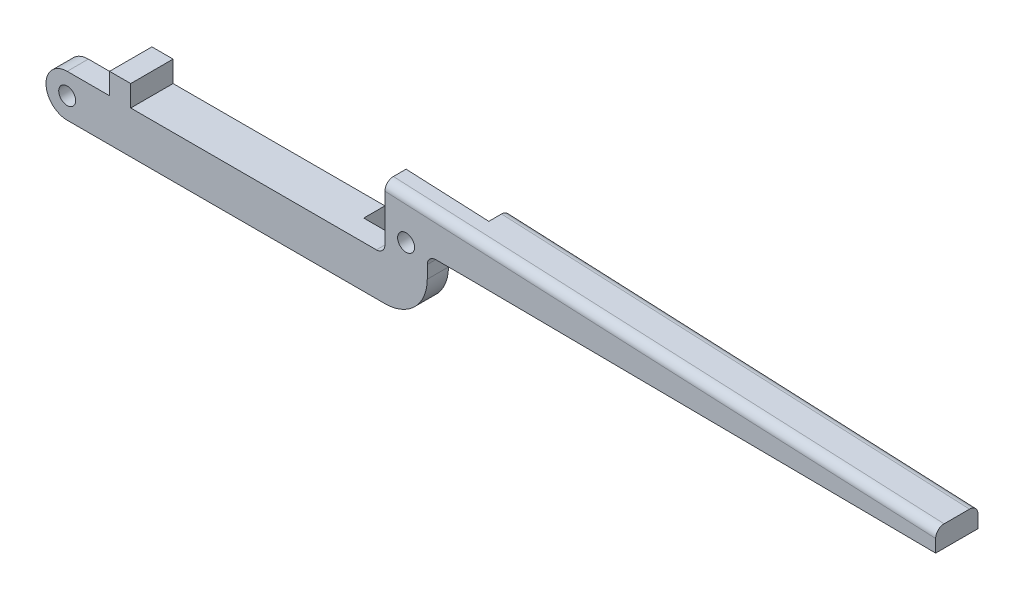
ISO-10303-21;
HEADER;
FILE_DESCRIPTION(('STEP AP214'),'2;1');
FILE_NAME('part.step','',(''),(''),'','','');
FILE_SCHEMA(('AUTOMOTIVE_DESIGN { 1 0 10303 214 1 1 1 1 }'));
ENDSEC;
DATA;
#1=APPLICATION_CONTEXT('core data for automotive mechanical design processes');
#2=APPLICATION_PROTOCOL_DEFINITION('international standard','automotive_design',2000,#1);
#3=PRODUCT_CONTEXT('',#1,'mechanical');
#4=PRODUCT('Part','Part','',(#3));
#5=PRODUCT_RELATED_PRODUCT_CATEGORY('part','',(#4));
#6=PRODUCT_DEFINITION_FORMATION('','',#4);
#7=PRODUCT_DEFINITION_CONTEXT('part definition',#1,'design');
#8=PRODUCT_DEFINITION('design','',#6,#7);
#9=PRODUCT_DEFINITION_SHAPE('','',#8);
#10=(LENGTH_UNIT() NAMED_UNIT(*) SI_UNIT(.MILLI.,.METRE.));
#11=(NAMED_UNIT(*) PLANE_ANGLE_UNIT() SI_UNIT($,.RADIAN.));
#12=(NAMED_UNIT(*) SI_UNIT($,.STERADIAN.) SOLID_ANGLE_UNIT());
#13=UNCERTAINTY_MEASURE_WITH_UNIT(LENGTH_MEASURE(1.E-05),#10,'distance_accuracy_value','');
#14=(GEOMETRIC_REPRESENTATION_CONTEXT(3) GLOBAL_UNCERTAINTY_ASSIGNED_CONTEXT((#13)) GLOBAL_UNIT_ASSIGNED_CONTEXT((#10,
#11,#12)) REPRESENTATION_CONTEXT('',''));
#15=CARTESIAN_POINT('',(0.,0.,0.));
#16=DIRECTION('',(0.,0.,1.));
#17=DIRECTION('',(1.,0.,0.));
#18=AXIS2_PLACEMENT_3D('',#15,#16,#17);
#19=CARTESIAN_POINT('',(22.500000000004,0.,2.5));
#20=DIRECTION('',(0.,1.,0.));
#21=DIRECTION('',(-1.,0.,0.));
#22=AXIS2_PLACEMENT_3D('',#19,#20,#21);
#23=PLANE('',#22);
#24=DIRECTION('',(0.,0.,-1.));
#25=VECTOR('',#24,1.);
#26=CARTESIAN_POINT('',(24.8820796081007,0.,2.5));
#27=LINE('',#26,#25);
#28=CARTESIAN_POINT('',(24.8820796081007,0.,2.5));
#29=VERTEX_POINT('',#28);
#30=CARTESIAN_POINT('',(24.8820796081007,0.,1.25));
#31=VERTEX_POINT('',#30);
#32=EDGE_CURVE('E234',#29,#31,#27,.T.);
#33=ORIENTED_EDGE('',*,*,#32,.F.);
#34=DIRECTION('',(1.,0.,0.));
#35=VECTOR('',#34,1.);
#36=CARTESIAN_POINT('',(22.500000000004,0.,2.5));
#37=LINE('',#36,#35);
#38=CARTESIAN_POINT('',(23.0000000000034,0.,2.5));
#39=VERTEX_POINT('',#38);
#40=EDGE_CURVE('E338',#39,#29,#37,.T.);
#41=ORIENTED_EDGE('',*,*,#40,.F.);
#42=DIRECTION('',(0.,0.,-1.));
#43=VECTOR('',#42,1.);
#44=CARTESIAN_POINT('',(23.0000000000034,0.,1.25));
#45=LINE('',#44,#43);
#46=CARTESIAN_POINT('',(23.0000000000034,0.,1.25));
#47=VERTEX_POINT('',#46);
#48=EDGE_CURVE('E378',#39,#47,#45,.T.);
#49=ORIENTED_EDGE('',*,*,#48,.T.);
#50=DIRECTION('',(-1.,0.,0.));
#51=VECTOR('',#50,1.);
#52=CARTESIAN_POINT('',(24.8820796081007,0.,1.25));
#53=LINE('',#52,#51);
#54=EDGE_CURVE('E273',#31,#47,#53,.T.);
#55=ORIENTED_EDGE('',*,*,#54,.F.);
#56=EDGE_LOOP('',(#33,#41,#49,#55));
#57=FACE_BOUND('',#56,.T.);
#58=ADVANCED_FACE('F40',(#57),#23,.F.);
#59=CARTESIAN_POINT('',(0.,-1.25,2.5));
#60=DIRECTION('',(0.,-1.,0.));
#61=DIRECTION('',(0.,0.,-1.));
#62=AXIS2_PLACEMENT_3D('',#59,#60,#61);
#63=PLANE('',#62);
#64=DIRECTION('',(-1.,0.,0.));
#65=VECTOR('',#64,1.);
#66=CARTESIAN_POINT('',(0.,-1.25,2.5));
#67=LINE('',#66,#65);
#68=CARTESIAN_POINT('',(3.75,-1.25,2.5));
#69=VERTEX_POINT('',#68);
#70=CARTESIAN_POINT('',(1.25,-1.25,2.5));
#71=VERTEX_POINT('',#70);
#72=EDGE_CURVE('E196',#69,#71,#67,.T.);
#73=ORIENTED_EDGE('',*,*,#72,.F.);
#74=DIRECTION('',(0.,0.,-1.));
#75=VECTOR('',#74,1.);
#76=CARTESIAN_POINT('',(3.75,-1.25,2.5));
#77=LINE('',#76,#75);
#78=CARTESIAN_POINT('',(3.75,-1.25,0.));
#79=VERTEX_POINT('',#78);
#80=EDGE_CURVE('E198',#69,#79,#77,.T.);
#81=ORIENTED_EDGE('',*,*,#80,.T.);
#82=DIRECTION('',(-1.,0.,0.));
#83=VECTOR('',#82,1.);
#84=CARTESIAN_POINT('',(2.5,-1.25,0.));
#85=LINE('',#84,#83);
#86=CARTESIAN_POINT('',(2.5,-1.25,0.));
#87=VERTEX_POINT('',#86);
#88=EDGE_CURVE('E219',#79,#87,#85,.T.);
#89=ORIENTED_EDGE('',*,*,#88,.T.);
#90=DIRECTION('',(0.,0.,-1.));
#91=VECTOR('',#90,1.);
#92=CARTESIAN_POINT('',(2.5,-1.25,2.5));
#93=LINE('',#92,#91);
#94=CARTESIAN_POINT('',(2.5,-1.25,1.25));
#95=VERTEX_POINT('',#94);
#96=EDGE_CURVE('E211',#95,#87,#93,.T.);
#97=ORIENTED_EDGE('',*,*,#96,.F.);
#98=DIRECTION('',(1.,0.,0.));
#99=VECTOR('',#98,1.);
#100=CARTESIAN_POINT('',(0.,-1.25,1.25));
#101=LINE('',#100,#99);
#102=CARTESIAN_POINT('',(1.25,-1.25,1.25));
#103=VERTEX_POINT('',#102);
#104=EDGE_CURVE('E307',#103,#95,#101,.T.);
#105=ORIENTED_EDGE('',*,*,#104,.F.);
#106=DIRECTION('',(0.,0.,-1.));
#107=VECTOR('',#106,1.);
#108=CARTESIAN_POINT('',(1.25,-1.25,2.5));
#109=LINE('',#108,#107);
#110=EDGE_CURVE('E201',#71,#103,#109,.T.);
#111=ORIENTED_EDGE('',*,*,#110,.F.);
#112=EDGE_LOOP('',(#73,#81,#89,#97,#105,#111));
#113=FACE_BOUND('',#112,.T.);
#114=ADVANCED_FACE('F197',(#113),#63,.F.);
#115=DIRECTION('',(0.,0.,-1.));
#116=VECTOR('',#115,1.);
#117=CARTESIAN_POINT('',(5.,-1.25,0.));
#118=LINE('',#117,#116);
#119=CARTESIAN_POINT('',(5.,-1.25,2.5));
#120=VERTEX_POINT('',#119);
#121=CARTESIAN_POINT('',(5.,-1.25,0.));
#122=VERTEX_POINT('',#121);
#123=EDGE_CURVE('E237',#120,#122,#118,.T.);
#124=ORIENTED_EDGE('',*,*,#123,.F.);
#125=CARTESIAN_POINT('',(19.5,-1.25,2.5));
#126=VERTEX_POINT('',#125);
#127=EDGE_CURVE('E204',#126,#120,#67,.T.);
#128=ORIENTED_EDGE('',*,*,#127,.F.);
#129=DIRECTION('',(0.,0.,-1.));
#130=VECTOR('',#129,1.);
#131=CARTESIAN_POINT('',(19.5,-1.25,1.25));
#132=LINE('',#131,#130);
#133=CARTESIAN_POINT('',(19.5,-1.25,1.25));
#134=VERTEX_POINT('',#133);
#135=EDGE_CURVE('E387',#126,#134,#132,.T.);
#136=ORIENTED_EDGE('',*,*,#135,.T.);
#137=DIRECTION('',(1.,0.,0.));
#138=VECTOR('',#137,1.);
#139=CARTESIAN_POINT('',(20.,-1.25,1.25));
#140=LINE('',#139,#138);
#141=CARTESIAN_POINT('',(17.5,-1.25,1.25));
#142=VERTEX_POINT('',#141);
#143=EDGE_CURVE('E288',#142,#134,#140,.T.);
#144=ORIENTED_EDGE('',*,*,#143,.F.);
#145=DIRECTION('',(0.,0.,-1.));
#146=VECTOR('',#145,1.);
#147=CARTESIAN_POINT('',(17.5,-1.25,1.25));
#148=LINE('',#147,#146);
#149=CARTESIAN_POINT('',(17.5,-1.25,0.));
#150=VERTEX_POINT('',#149);
#151=EDGE_CURVE('E295',#142,#150,#148,.T.);
#152=ORIENTED_EDGE('',*,*,#151,.T.);
#153=DIRECTION('',(-1.,0.,0.));
#154=VECTOR('',#153,1.);
#155=CARTESIAN_POINT('',(0.,-1.25,0.));
#156=LINE('',#155,#154);
#157=EDGE_CURVE('E332',#150,#122,#156,.T.);
#158=ORIENTED_EDGE('',*,*,#157,.T.);
#159=EDGE_LOOP('',(#124,#128,#136,#144,#152,#158));
#160=FACE_BOUND('',#159,.T.);
#161=ADVANCED_FACE('F403',(#160),#63,.F.);
#162=CARTESIAN_POINT('',(0.,0.,0.));
#163=DIRECTION('',(0.,0.,1.));
#164=DIRECTION('',(1.,0.,0.));
#165=AXIS2_PLACEMENT_3D('',#162,#163,#164);
#166=PLANE('',#165);
#167=DIRECTION('',(0.,1.,0.));
#168=VECTOR('',#167,1.);
#169=CARTESIAN_POINT('',(2.5,0.,0.));
#170=LINE('',#169,#168);
#171=CARTESIAN_POINT('',(2.5,-3.75,0.));
#172=VERTEX_POINT('',#171);
#173=EDGE_CURVE('E254',#172,#87,#170,.T.);
#174=ORIENTED_EDGE('',*,*,#173,.T.);
#175=ORIENTED_EDGE('',*,*,#88,.F.);
#176=DIRECTION('',(0.,-1.,0.));
#177=VECTOR('',#176,1.);
#178=CARTESIAN_POINT('',(3.75,-1.25,0.));
#179=LINE('',#178,#177);
#180=CARTESIAN_POINT('',(3.75,0.,0.));
#181=VERTEX_POINT('',#180);
#182=EDGE_CURVE('E209',#181,#79,#179,.T.);
#183=ORIENTED_EDGE('',*,*,#182,.F.);
#184=DIRECTION('',(-1.,0.,0.));
#185=VECTOR('',#184,1.);
#186=CARTESIAN_POINT('',(2.5,0.,0.));
#187=LINE('',#186,#185);
#188=CARTESIAN_POINT('',(5.,0.,0.));
#189=VERTEX_POINT('',#188);
#190=EDGE_CURVE('E242',#189,#181,#187,.T.);
#191=ORIENTED_EDGE('',*,*,#190,.F.);
#192=DIRECTION('',(0.,-1.,0.));
#193=VECTOR('',#192,1.);
#194=CARTESIAN_POINT('',(5.,0.,0.));
#195=LINE('',#194,#193);
#196=EDGE_CURVE('E245',#189,#122,#195,.T.);
#197=ORIENTED_EDGE('',*,*,#196,.T.);
#198=ORIENTED_EDGE('',*,*,#157,.F.);
#199=DIRECTION('',(0.,1.,0.));
#200=VECTOR('',#199,1.);
#201=CARTESIAN_POINT('',(17.5,-1.25,0.));
#202=LINE('',#201,#200);
#203=CARTESIAN_POINT('',(17.5,-3.75,0.));
#204=VERTEX_POINT('',#203);
#205=EDGE_CURVE('E258',#204,#150,#202,.T.);
#206=ORIENTED_EDGE('',*,*,#205,.F.);
#207=DIRECTION('',(1.,0.,0.));
#208=VECTOR('',#207,1.);
#209=CARTESIAN_POINT('',(20.,-3.75,0.));
#210=LINE('',#209,#208);
#211=EDGE_CURVE('E347',#172,#204,#210,.T.);
#212=ORIENTED_EDGE('',*,*,#211,.F.);
#213=EDGE_LOOP('',(#174,#175,#183,#191,#197,#198,#206,#212));
#214=FACE_BOUND('',#213,.T.);
#215=ADVANCED_FACE('F414',(#214),#166,.F.);
#216=CARTESIAN_POINT('',(20.,-3.75,2.5));
#217=DIRECTION('',(0.,1.,0.));
#218=DIRECTION('',(0.,0.,1.));
#219=AXIS2_PLACEMENT_3D('',#216,#217,#218);
#220=PLANE('',#219);
#221=DIRECTION('',(0.,0.,-1.));
#222=VECTOR('',#221,1.);
#223=CARTESIAN_POINT('',(2.5,-3.75,1.25));
#224=LINE('',#223,#222);
#225=CARTESIAN_POINT('',(2.5,-3.75,1.25));
#226=VERTEX_POINT('',#225);
#227=EDGE_CURVE('E251',#226,#172,#224,.T.);
#228=ORIENTED_EDGE('',*,*,#227,.T.);
#229=ORIENTED_EDGE('',*,*,#211,.T.);
#230=DIRECTION('',(0.,0.,-1.));
#231=VECTOR('',#230,1.);
#232=CARTESIAN_POINT('',(17.5,-3.75,1.25));
#233=LINE('',#232,#231);
#234=CARTESIAN_POINT('',(17.5,-3.75,1.25));
#235=VERTEX_POINT('',#234);
#236=EDGE_CURVE('E265',#235,#204,#233,.T.);
#237=ORIENTED_EDGE('',*,*,#236,.F.);
#238=DIRECTION('',(-1.,0.,0.));
#239=VECTOR('',#238,1.);
#240=CARTESIAN_POINT('',(17.5,-3.75,1.25));
#241=LINE('',#240,#239);
#242=CARTESIAN_POINT('',(20.,-3.75,1.25));
#243=VERTEX_POINT('',#242);
#244=EDGE_CURVE('E261',#243,#235,#241,.T.);
#245=ORIENTED_EDGE('',*,*,#244,.F.);
#246=DIRECTION('',(0.,0.,-1.));
#247=VECTOR('',#246,1.);
#248=CARTESIAN_POINT('',(20.,-3.75,2.5));
#249=LINE('',#248,#247);
#250=CARTESIAN_POINT('',(20.,-3.75,2.5));
#251=VERTEX_POINT('',#250);
#252=EDGE_CURVE('E285',#251,#243,#249,.T.);
#253=ORIENTED_EDGE('',*,*,#252,.F.);
#254=DIRECTION('',(1.,0.,0.));
#255=VECTOR('',#254,1.);
#256=CARTESIAN_POINT('',(0.,-3.75,2.5));
#257=LINE('',#256,#255);
#258=CARTESIAN_POINT('',(1.25,-3.75,2.5));
#259=VERTEX_POINT('',#258);
#260=EDGE_CURVE('E335',#259,#251,#257,.T.);
#261=ORIENTED_EDGE('',*,*,#260,.F.);
#262=DIRECTION('',(0.,0.,-1.));
#263=VECTOR('',#262,1.);
#264=CARTESIAN_POINT('',(1.25,-3.75,2.5));
#265=LINE('',#264,#263);
#266=CARTESIAN_POINT('',(1.25,-3.75,1.25));
#267=VERTEX_POINT('',#266);
#268=EDGE_CURVE('E294',#259,#267,#265,.T.);
#269=ORIENTED_EDGE('',*,*,#268,.T.);
#270=DIRECTION('',(-1.,0.,0.));
#271=VECTOR('',#270,1.);
#272=CARTESIAN_POINT('',(0.,-3.75,1.25));
#273=LINE('',#272,#271);
#274=EDGE_CURVE('E311',#226,#267,#273,.T.);
#275=ORIENTED_EDGE('',*,*,#274,.F.);
#276=EDGE_LOOP('',(#228,#229,#237,#245,#253,#261,#269,#275));
#277=FACE_BOUND('',#276,.T.);
#278=ADVANCED_FACE('F435',(#277),#220,.F.);
#279=CARTESIAN_POINT('',(0.,0.,1.25));
#280=DIRECTION('',(0.,0.,-1.));
#281=DIRECTION('',(-1.,0.,0.));
#282=AXIS2_PLACEMENT_3D('',#279,#280,#281);
#283=PLANE('',#282);
#284=CARTESIAN_POINT('',(1.25,-2.5,1.25));
#285=DIRECTION('',(0.,0.,-1.));
#286=DIRECTION('',(-1.,0.,0.));
#287=AXIS2_PLACEMENT_3D('',#284,#285,#286);
#288=CIRCLE('',#287,0.5);
#289=CARTESIAN_POINT('',(0.75,-2.5,1.25));
#290=VERTEX_POINT('',#289);
#291=EDGE_CURVE('E313',#290,#290,#288,.F.);
#292=ORIENTED_EDGE('',*,*,#291,.T.);
#293=EDGE_LOOP('',(#292));
#294=FACE_BOUND('',#293,.T.);
#295=ORIENTED_EDGE('',*,*,#104,.T.);
#296=DIRECTION('',(0.,1.,0.));
#297=VECTOR('',#296,1.);
#298=CARTESIAN_POINT('',(2.5,0.,1.25));
#299=LINE('',#298,#297);
#300=EDGE_CURVE('E255',#226,#95,#299,.T.);
#301=ORIENTED_EDGE('',*,*,#300,.F.);
#302=ORIENTED_EDGE('',*,*,#274,.T.);
#303=CARTESIAN_POINT('',(1.25,-2.5,1.25));
#304=DIRECTION('',(0.,0.,-1.));
#305=DIRECTION('',(-1.,0.,0.));
#306=AXIS2_PLACEMENT_3D('',#303,#304,#305);
#307=CIRCLE('',#306,1.25);
#308=EDGE_CURVE('E301',#267,#103,#307,.T.);
#309=ORIENTED_EDGE('',*,*,#308,.T.);
#310=EDGE_LOOP('',(#295,#301,#302,#309));
#311=FACE_BOUND('',#310,.T.);
#312=ADVANCED_FACE('F428',(#294,#311),#283,.T.);
#313=CARTESIAN_POINT('',(22.500000000004,0.,2.5));
#314=DIRECTION('',(-1.,1.06118817437088E-12,0.));
#315=DIRECTION('',(-1.06118817437088E-12,-1.,0.));
#316=AXIS2_PLACEMENT_3D('',#313,#314,#315);
#317=PLANE('',#316);
#318=DIRECTION('',(0.,-1.,0.));
#319=VECTOR('',#318,1.);
#320=CARTESIAN_POINT('',(22.5,-3.75,1.25));
#321=LINE('',#320,#319);
#322=CARTESIAN_POINT('',(22.5,-0.49999999999947,1.25));
#323=VERTEX_POINT('',#322);
#324=CARTESIAN_POINT('',(22.5,-1.25,1.25));
#325=VERTEX_POINT('',#324);
#326=EDGE_CURVE('E308',#323,#325,#321,.T.);
#327=ORIENTED_EDGE('',*,*,#326,.F.);
#328=DIRECTION('',(0.,0.,-1.));
#329=VECTOR('',#328,1.);
#330=CARTESIAN_POINT('',(22.5000000000034,-0.499999999999469,2.5));
#331=LINE('',#330,#329);
#332=CARTESIAN_POINT('',(22.5,-0.49999999999947,2.5));
#333=VERTEX_POINT('',#332);
#334=EDGE_CURVE('E381',#323,#333,#331,.F.);
#335=ORIENTED_EDGE('',*,*,#334,.T.);
#336=DIRECTION('',(0.,1.,0.));
#337=VECTOR('',#336,1.);
#338=CARTESIAN_POINT('',(22.5,-3.75,2.5));
#339=LINE('',#338,#337);
#340=CARTESIAN_POINT('',(22.5,-1.25,2.5));
#341=VERTEX_POINT('',#340);
#342=EDGE_CURVE('E322',#341,#333,#339,.T.);
#343=ORIENTED_EDGE('',*,*,#342,.F.);
#344=DIRECTION('',(0.,0.,-1.));
#345=VECTOR('',#344,1.);
#346=CARTESIAN_POINT('',(22.5,-1.25,2.5));
#347=LINE('',#346,#345);
#348=EDGE_CURVE('E282',#341,#325,#347,.T.);
#349=ORIENTED_EDGE('',*,*,#348,.T.);
#350=EDGE_LOOP('',(#327,#335,#343,#349));
#351=FACE_BOUND('',#350,.T.);
#352=ADVANCED_FACE('F442',(#351),#317,.F.);
#353=CARTESIAN_POINT('',(0.,0.,2.5));
#354=DIRECTION('',(0.,0.,1.));
#355=DIRECTION('',(1.,0.,0.));
#356=AXIS2_PLACEMENT_3D('',#353,#354,#355);
#357=PLANE('',#356);
#358=DIRECTION('',(0.,-1.,0.));
#359=VECTOR('',#358,1.);
#360=CARTESIAN_POINT('',(3.75,-1.25,2.5));
#361=LINE('',#360,#359);
#362=CARTESIAN_POINT('',(3.75,0.,2.5));
#363=VERTEX_POINT('',#362);
#364=EDGE_CURVE('E55',#363,#69,#361,.T.);
#365=ORIENTED_EDGE('',*,*,#364,.T.);
#366=ORIENTED_EDGE('',*,*,#72,.T.);
#367=CARTESIAN_POINT('',(1.25,-2.5,2.5));
#368=DIRECTION('',(0.,0.,-1.));
#369=DIRECTION('',(-1.,0.,0.));
#370=AXIS2_PLACEMENT_3D('',#367,#368,#369);
#371=CIRCLE('',#370,1.25);
#372=EDGE_CURVE('E302',#259,#71,#371,.T.);
#373=ORIENTED_EDGE('',*,*,#372,.F.);
#374=ORIENTED_EDGE('',*,*,#260,.T.);
#375=CARTESIAN_POINT('',(20.,-1.25,2.5));
#376=DIRECTION('',(0.,0.,1.));
#377=DIRECTION('',(-1.,0.,0.));
#378=AXIS2_PLACEMENT_3D('',#375,#376,#377);
#379=CIRCLE('',#378,2.5);
#380=EDGE_CURVE('E279',#251,#341,#379,.T.);
#381=ORIENTED_EDGE('',*,*,#380,.T.);
#382=ORIENTED_EDGE('',*,*,#342,.T.);
#383=CARTESIAN_POINT('',(23.0000000000034,-0.5,2.5));
#384=DIRECTION('',(0.,0.,1.));
#385=DIRECTION('',(1.,0.,0.));
#386=AXIS2_PLACEMENT_3D('',#383,#384,#385);
#387=CIRCLE('',#386,0.5);
#388=EDGE_CURVE('E385',#333,#39,#387,.F.);
#389=ORIENTED_EDGE('',*,*,#388,.T.);
#390=ORIENTED_EDGE('',*,*,#40,.T.);
#391=DIRECTION('',(0.999959032318532,-0.00905172274133137,0.));
#392=VECTOR('',#391,1.);
#393=CARTESIAN_POINT('',(24.8820796081007,0.,2.5));
#394=LINE('',#393,#392);
#395=CARTESIAN_POINT('',(52.5,-0.25,2.5));
#396=VERTEX_POINT('',#395);
#397=EDGE_CURVE('E228',#29,#396,#394,.T.);
#398=ORIENTED_EDGE('',*,*,#397,.T.);
#399=DIRECTION('',(0.,1.,0.));
#400=VECTOR('',#399,1.);
#401=CARTESIAN_POINT('',(52.5,0.,2.5));
#402=LINE('',#401,#400);
#403=CARTESIAN_POINT('',(52.5,0.499467738923156,2.5));
#404=VERTEX_POINT('',#403);
#405=EDGE_CURVE('E341',#396,#404,#402,.T.);
#406=ORIENTED_EDGE('',*,*,#405,.T.);
#407=DIRECTION('',(-0.998936609848685,0.0461047666084009,0.));
#408=VECTOR('',#407,1.);
#409=CARTESIAN_POINT('',(19.9769476166958,2.00053169507566,2.5));
#410=LINE('',#409,#408);
#411=CARTESIAN_POINT('',(20.,1.99946773892316,2.5));
#412=VERTEX_POINT('',#411);
#413=EDGE_CURVE('E373',#404,#412,#410,.T.);
#414=ORIENTED_EDGE('',*,*,#413,.T.);
#415=DIRECTION('',(0.,-1.,0.));
#416=VECTOR('',#415,1.);
#417=CARTESIAN_POINT('',(20.,-3.75,2.5));
#418=LINE('',#417,#416);
#419=CARTESIAN_POINT('',(20.,-0.75,2.5));
#420=VERTEX_POINT('',#419);
#421=EDGE_CURVE('E325',#412,#420,#418,.T.);
#422=ORIENTED_EDGE('',*,*,#421,.T.);
#423=CARTESIAN_POINT('',(19.5,-0.75,2.5));
#424=DIRECTION('',(0.,0.,1.));
#425=DIRECTION('',(1.,0.,0.));
#426=AXIS2_PLACEMENT_3D('',#423,#424,#425);
#427=CIRCLE('',#426,0.5);
#428=EDGE_CURVE('E11',#420,#126,#427,.F.);
#429=ORIENTED_EDGE('',*,*,#428,.T.);
#430=ORIENTED_EDGE('',*,*,#127,.T.);
#431=DIRECTION('',(0.,-1.,0.));
#432=VECTOR('',#431,1.);
#433=CARTESIAN_POINT('',(5.,0.,2.5));
#434=LINE('',#433,#432);
#435=CARTESIAN_POINT('',(5.,0.,2.5));
#436=VERTEX_POINT('',#435);
#437=EDGE_CURVE('E249',#436,#120,#434,.T.);
#438=ORIENTED_EDGE('',*,*,#437,.F.);
#439=DIRECTION('',(1.,0.,0.));
#440=VECTOR('',#439,1.);
#441=CARTESIAN_POINT('',(2.5,0.,2.5));
#442=LINE('',#441,#440);
#443=EDGE_CURVE('E218',#363,#436,#442,.T.);
#444=ORIENTED_EDGE('',*,*,#443,.F.);
#445=EDGE_LOOP('',(#365,#366,#373,#374,#381,#382,#389,#390,#398,#406,#414,#422,#429,#430,#438,#444));
#446=FACE_BOUND('',#445,.T.);
#447=CARTESIAN_POINT('',(1.25,-2.5,2.5));
#448=DIRECTION('',(0.,0.,1.));
#449=DIRECTION('',(1.,0.,0.));
#450=AXIS2_PLACEMENT_3D('',#447,#448,#449);
#451=CIRCLE('',#450,0.5);
#452=CARTESIAN_POINT('',(1.75,-2.5,2.5));
#453=VERTEX_POINT('',#452);
#454=EDGE_CURVE('E328',#453,#453,#451,.T.);
#455=ORIENTED_EDGE('',*,*,#454,.F.);
#456=EDGE_LOOP('',(#455));
#457=FACE_BOUND('',#456,.T.);
#458=CARTESIAN_POINT('',(21.25,0.,2.5));
#459=DIRECTION('',(0.,0.,1.));
#460=DIRECTION('',(1.,0.,0.));
#461=AXIS2_PLACEMENT_3D('',#458,#459,#460);
#462=CIRCLE('',#461,0.500000000000002);
#463=CARTESIAN_POINT('',(21.75,0.,2.5));
#464=VERTEX_POINT('',#463);
#465=EDGE_CURVE('E320',#464,#464,#462,.T.);
#466=ORIENTED_EDGE('',*,*,#465,.F.);
#467=EDGE_LOOP('',(#466));
#468=FACE_BOUND('',#467,.T.);
#469=ADVANCED_FACE('F215',(#446,#457,#468),#357,.T.);
#470=DIRECTION('',(0.,1.,0.));
#471=VECTOR('',#470,1.);
#472=CARTESIAN_POINT('',(52.5,0.,0.));
#473=LINE('',#472,#471);
#474=CARTESIAN_POINT('',(52.5,-0.25,0.));
#475=VERTEX_POINT('',#474);
#476=CARTESIAN_POINT('',(52.5,0.499467738923155,0.));
#477=VERTEX_POINT('',#476);
#478=EDGE_CURVE('E205',#475,#477,#473,.T.);
#479=ORIENTED_EDGE('',*,*,#478,.F.);
#480=DIRECTION('',(0.999959032318532,-0.00905172274133137,0.));
#481=VECTOR('',#480,1.);
#482=CARTESIAN_POINT('',(24.8820796081007,0.,0.));
#483=LINE('',#482,#481);
#484=CARTESIAN_POINT('',(24.8820796081007,0.,0.));
#485=VERTEX_POINT('',#484);
#486=EDGE_CURVE('E226',#485,#475,#483,.T.);
#487=ORIENTED_EDGE('',*,*,#486,.F.);
#488=DIRECTION('',(0.,-1.,0.));
#489=VECTOR('',#488,1.);
#490=CARTESIAN_POINT('',(24.8820796081007,2.27467324885689,0.));
#491=LINE('',#490,#489);
#492=CARTESIAN_POINT('',(24.8820796081007,1.77414098778005,0.));
#493=VERTEX_POINT('',#492);
#494=EDGE_CURVE('E269',#493,#485,#491,.T.);
#495=ORIENTED_EDGE('',*,*,#494,.F.);
#496=DIRECTION('',(-0.998936609848685,0.0461047666084009,0.));
#497=VECTOR('',#496,1.);
#498=CARTESIAN_POINT('',(0.134599954910254,2.91633235638884,0.));
#499=LINE('',#498,#497);
#500=EDGE_CURVE('E367',#493,#477,#499,.F.);
#501=ORIENTED_EDGE('',*,*,#500,.T.);
#502=EDGE_LOOP('',(#479,#487,#495,#501));
#503=FACE_BOUND('',#502,.T.);
#504=ADVANCED_FACE('F468',(#503),#166,.F.);
#505=CARTESIAN_POINT('',(1.25,-2.5,0.));
#506=DIRECTION('',(0.,0.,1.));
#507=DIRECTION('',(1.,0.,0.));
#508=AXIS2_PLACEMENT_3D('',#505,#506,#507);
#509=CYLINDRICAL_SURFACE('',#508,0.5);
#510=ORIENTED_EDGE('',*,*,#454,.T.);
#511=EDGE_LOOP('',(#510));
#512=FACE_BOUND('',#511,.T.);
#513=ORIENTED_EDGE('',*,*,#291,.F.);
#514=EDGE_LOOP('',(#513));
#515=FACE_BOUND('',#514,.T.);
#516=ADVANCED_FACE('F512',(#512,#515),#509,.F.);
#517=CARTESIAN_POINT('',(20.,-1.25,2.5));
#518=DIRECTION('',(1.,0.,0.));
#519=DIRECTION('',(0.,0.,-1.));
#520=AXIS2_PLACEMENT_3D('',#517,#518,#519);
#521=PLANE('',#520);
#522=DIRECTION('',(0.,1.,0.));
#523=VECTOR('',#522,1.);
#524=CARTESIAN_POINT('',(20.,-3.75,1.25));
#525=LINE('',#524,#523);
#526=CARTESIAN_POINT('',(20.,-0.75,1.25));
#527=VERTEX_POINT('',#526);
#528=CARTESIAN_POINT('',(20.,2.5,1.25));
#529=VERTEX_POINT('',#528);
#530=EDGE_CURVE('E310',#527,#529,#525,.T.);
#531=ORIENTED_EDGE('',*,*,#530,.F.);
#532=DIRECTION('',(0.,0.,-1.));
#533=VECTOR('',#532,1.);
#534=CARTESIAN_POINT('',(20.,-0.75,2.5));
#535=LINE('',#534,#533);
#536=EDGE_CURVE('E390',#527,#420,#535,.F.);
#537=ORIENTED_EDGE('',*,*,#536,.T.);
#538=ORIENTED_EDGE('',*,*,#421,.F.);
#539=CARTESIAN_POINT('',(20.,1.99946773892316,2.));
#540=DIRECTION('',(1.,0.,0.));
#541=DIRECTION('',(0.,-1.,0.));
#542=AXIS2_PLACEMENT_3D('',#539,#540,#541);
#543=ELLIPSE('',#542,0.500532261076844,0.5);
#544=CARTESIAN_POINT('',(20.,2.5,2.));
#545=VERTEX_POINT('',#544);
#546=EDGE_CURVE('E376',#412,#545,#543,.F.);
#547=ORIENTED_EDGE('',*,*,#546,.T.);
#548=DIRECTION('',(0.,0.,-1.));
#549=VECTOR('',#548,1.);
#550=CARTESIAN_POINT('',(20.,2.5,2.5));
#551=LINE('',#550,#549);
#552=EDGE_CURVE('E344',#545,#529,#551,.T.);
#553=ORIENTED_EDGE('',*,*,#552,.T.);
#554=EDGE_LOOP('',(#531,#537,#538,#547,#553));
#555=FACE_BOUND('',#554,.T.);
#556=ADVANCED_FACE('F394',(#555),#521,.F.);
#557=CARTESIAN_POINT('',(52.5,0.,2.5));
#558=DIRECTION('',(-1.,0.,0.));
#559=DIRECTION('',(0.,0.,1.));
#560=AXIS2_PLACEMENT_3D('',#557,#558,#559);
#561=PLANE('',#560);
#562=ORIENTED_EDGE('',*,*,#478,.T.);
#563=CARTESIAN_POINT('',(52.5,0.499467738923156,0.5));
#564=DIRECTION('',(-1.,0.,0.));
#565=DIRECTION('',(0.,1.,0.));
#566=AXIS2_PLACEMENT_3D('',#563,#564,#565);
#567=ELLIPSE('',#566,0.500532261076844,0.5);
#568=CARTESIAN_POINT('',(52.5,1.,0.5));
#569=VERTEX_POINT('',#568);
#570=EDGE_CURVE('E371',#477,#569,#567,.F.);
#571=ORIENTED_EDGE('',*,*,#570,.T.);
#572=DIRECTION('',(0.,0.,-1.));
#573=VECTOR('',#572,1.);
#574=CARTESIAN_POINT('',(52.5,1.,2.5));
#575=LINE('',#574,#573);
#576=CARTESIAN_POINT('',(52.5,1.,2.));
#577=VERTEX_POINT('',#576);
#578=EDGE_CURVE('E353',#577,#569,#575,.T.);
#579=ORIENTED_EDGE('',*,*,#578,.F.);
#580=CARTESIAN_POINT('',(52.5,0.499467738923156,2.));
#581=DIRECTION('',(-1.,0.,0.));
#582=DIRECTION('',(0.,-1.,0.));
#583=AXIS2_PLACEMENT_3D('',#580,#581,#582);
#584=ELLIPSE('',#583,0.500532261076844,0.5);
#585=EDGE_CURVE('E369',#577,#404,#584,.F.);
#586=ORIENTED_EDGE('',*,*,#585,.T.);
#587=ORIENTED_EDGE('',*,*,#405,.F.);
#588=DIRECTION('',(0.,0.,1.));
#589=VECTOR('',#588,1.);
#590=CARTESIAN_POINT('',(52.5,-0.25,2.5));
#591=LINE('',#590,#589);
#592=EDGE_CURVE('E235',#475,#396,#591,.T.);
#593=ORIENTED_EDGE('',*,*,#592,.F.);
#594=EDGE_LOOP('',(#562,#571,#579,#586,#587,#593));
#595=FACE_BOUND('',#594,.T.);
#596=ADVANCED_FACE('F473',(#595),#561,.F.);
#597=CARTESIAN_POINT('',(52.5,1.,2.5));
#598=DIRECTION('',(-0.0461047666084009,-0.998936609848685,0.));
#599=DIRECTION('',(0.998936609848685,-0.0461047666084009,0.));
#600=AXIS2_PLACEMENT_3D('',#597,#598,#599);
#601=PLANE('',#600);
#602=ORIENTED_EDGE('',*,*,#578,.T.);
#603=DIRECTION('',(-0.998936609848685,0.0461047666084009,0.));
#604=VECTOR('',#603,1.);
#605=CARTESIAN_POINT('',(52.5,1.,0.5));
#606=LINE('',#605,#604);
#607=CARTESIAN_POINT('',(24.8820796081007,2.27467324885689,0.5));
#608=VERTEX_POINT('',#607);
#609=EDGE_CURVE('E362',#569,#608,#606,.T.);
#610=ORIENTED_EDGE('',*,*,#609,.T.);
#611=DIRECTION('',(0.,0.,-1.));
#612=VECTOR('',#611,1.);
#613=CARTESIAN_POINT('',(24.8820796081007,2.27467324885689,1.25));
#614=LINE('',#613,#612);
#615=CARTESIAN_POINT('',(24.8820796081007,2.27467324885689,1.25));
#616=VERTEX_POINT('',#615);
#617=EDGE_CURVE('E291',#616,#608,#614,.T.);
#618=ORIENTED_EDGE('',*,*,#617,.F.);
#619=DIRECTION('',(-0.998936609848685,0.0461047666084009,0.));
#620=VECTOR('',#619,1.);
#621=CARTESIAN_POINT('',(52.5,1.,1.25));
#622=LINE('',#621,#620);
#623=EDGE_CURVE('E317',#616,#529,#622,.T.);
#624=ORIENTED_EDGE('',*,*,#623,.T.);
#625=ORIENTED_EDGE('',*,*,#552,.F.);
#626=DIRECTION('',(-0.998936609848685,0.0461047666084009,0.));
#627=VECTOR('',#626,1.);
#628=CARTESIAN_POINT('',(52.5,1.,2.));
#629=LINE('',#628,#627);
#630=EDGE_CURVE('E356',#545,#577,#629,.F.);
#631=ORIENTED_EDGE('',*,*,#630,.T.);
#632=EDGE_LOOP('',(#602,#610,#618,#624,#625,#631));
#633=FACE_BOUND('',#632,.T.);
#634=ADVANCED_FACE('F462',(#633),#601,.F.);
#635=CARTESIAN_POINT('',(21.25,0.,0.));
#636=DIRECTION('',(0.,0.,1.));
#637=DIRECTION('',(1.,0.,0.));
#638=AXIS2_PLACEMENT_3D('',#635,#636,#637);
#639=CYLINDRICAL_SURFACE('',#638,0.499999999999999);
#640=CARTESIAN_POINT('',(21.25,0.,1.25));
#641=DIRECTION('',(0.,0.,1.));
#642=DIRECTION('',(1.,0.,0.));
#643=AXIS2_PLACEMENT_3D('',#640,#641,#642);
#644=CIRCLE('',#643,0.499999999999999);
#645=CARTESIAN_POINT('',(21.75,0.,1.25));
#646=VERTEX_POINT('',#645);
#647=EDGE_CURVE('E321',#646,#646,#644,.F.);
#648=ORIENTED_EDGE('',*,*,#647,.T.);
#649=EDGE_LOOP('',(#648));
#650=FACE_BOUND('',#649,.T.);
#651=ORIENTED_EDGE('',*,*,#465,.T.);
#652=EDGE_LOOP('',(#651));
#653=FACE_BOUND('',#652,.T.);
#654=ADVANCED_FACE('F522',(#650,#653),#639,.F.);
#655=CARTESIAN_POINT('',(0.,0.,1.25));
#656=DIRECTION('',(0.,0.,1.));
#657=DIRECTION('',(1.,0.,0.));
#658=AXIS2_PLACEMENT_3D('',#655,#656,#657);
#659=PLANE('',#658);
#660=ORIENTED_EDGE('',*,*,#647,.F.);
#661=EDGE_LOOP('',(#660));
#662=FACE_BOUND('',#661,.T.);
#663=ORIENTED_EDGE('',*,*,#54,.T.);
#664=CARTESIAN_POINT('',(23.0000000000034,-0.5,1.25));
#665=DIRECTION('',(0.,0.,1.));
#666=DIRECTION('',(1.,0.,0.));
#667=AXIS2_PLACEMENT_3D('',#664,#665,#666);
#668=CIRCLE('',#667,0.5);
#669=EDGE_CURVE('E383',#47,#323,#668,.T.);
#670=ORIENTED_EDGE('',*,*,#669,.T.);
#671=ORIENTED_EDGE('',*,*,#326,.T.);
#672=CARTESIAN_POINT('',(20.,-1.25,1.25));
#673=DIRECTION('',(0.,0.,1.));
#674=DIRECTION('',(-1.,0.,0.));
#675=AXIS2_PLACEMENT_3D('',#672,#673,#674);
#676=CIRCLE('',#675,2.5);
#677=EDGE_CURVE('E276',#243,#325,#676,.T.);
#678=ORIENTED_EDGE('',*,*,#677,.F.);
#679=ORIENTED_EDGE('',*,*,#244,.T.);
#680=DIRECTION('',(0.,1.,0.));
#681=VECTOR('',#680,1.);
#682=CARTESIAN_POINT('',(17.5,-1.25,1.25));
#683=LINE('',#682,#681);
#684=EDGE_CURVE('E263',#235,#142,#683,.T.);
#685=ORIENTED_EDGE('',*,*,#684,.T.);
#686=ORIENTED_EDGE('',*,*,#143,.T.);
#687=CARTESIAN_POINT('',(19.5,-0.75,1.25));
#688=DIRECTION('',(0.,0.,1.));
#689=DIRECTION('',(1.,0.,0.));
#690=AXIS2_PLACEMENT_3D('',#687,#688,#689);
#691=CIRCLE('',#690,0.5);
#692=EDGE_CURVE('E48',#134,#527,#691,.T.);
#693=ORIENTED_EDGE('',*,*,#692,.T.);
#694=ORIENTED_EDGE('',*,*,#530,.T.);
#695=ORIENTED_EDGE('',*,*,#623,.F.);
#696=DIRECTION('',(0.,-1.,0.));
#697=VECTOR('',#696,1.);
#698=CARTESIAN_POINT('',(24.8820796081007,2.27467324885689,1.25));
#699=LINE('',#698,#697);
#700=EDGE_CURVE('E270',#616,#31,#699,.T.);
#701=ORIENTED_EDGE('',*,*,#700,.T.);
#702=EDGE_LOOP('',(#663,#670,#671,#678,#679,#685,#686,#693,#694,#695,#701));
#703=FACE_BOUND('',#702,.T.);
#704=ADVANCED_FACE('F404',(#662,#703),#659,.F.);
#705=CARTESIAN_POINT('',(1.25,-2.5,2.5));
#706=DIRECTION('',(0.,0.,-1.));
#707=DIRECTION('',(-1.,0.,0.));
#708=AXIS2_PLACEMENT_3D('',#705,#706,#707);
#709=CYLINDRICAL_SURFACE('',#708,1.25);
#710=ORIENTED_EDGE('',*,*,#308,.F.);
#711=ORIENTED_EDGE('',*,*,#268,.F.);
#712=ORIENTED_EDGE('',*,*,#372,.T.);
#713=ORIENTED_EDGE('',*,*,#110,.T.);
#714=EDGE_LOOP('',(#710,#711,#712,#713));
#715=FACE_BOUND('',#714,.T.);
#716=ADVANCED_FACE('F432',(#715),#709,.T.);
#717=CARTESIAN_POINT('',(20.,-1.25,2.5));
#718=DIRECTION('',(0.,0.,-1.));
#719=DIRECTION('',(-1.,0.,0.));
#720=AXIS2_PLACEMENT_3D('',#717,#718,#719);
#721=CYLINDRICAL_SURFACE('',#720,2.5);
#722=ORIENTED_EDGE('',*,*,#677,.T.);
#723=ORIENTED_EDGE('',*,*,#348,.F.);
#724=ORIENTED_EDGE('',*,*,#380,.F.);
#725=ORIENTED_EDGE('',*,*,#252,.T.);
#726=EDGE_LOOP('',(#722,#723,#724,#725));
#727=FACE_BOUND('',#726,.T.);
#728=ADVANCED_FACE('F531',(#727),#721,.T.);
#729=CARTESIAN_POINT('',(24.8820796081007,2.27467324885689,1.25));
#730=DIRECTION('',(1.,0.,0.));
#731=DIRECTION('',(0.,0.,-1.));
#732=AXIS2_PLACEMENT_3D('',#729,#730,#731);
#733=PLANE('',#732);
#734=ORIENTED_EDGE('',*,*,#494,.T.);
#735=DIRECTION('',(0.,0.,-1.));
#736=VECTOR('',#735,1.);
#737=CARTESIAN_POINT('',(24.8820796081007,0.,2.5));
#738=LINE('',#737,#736);
#739=EDGE_CURVE('E231',#31,#485,#738,.T.);
#740=ORIENTED_EDGE('',*,*,#739,.F.);
#741=ORIENTED_EDGE('',*,*,#700,.F.);
#742=ORIENTED_EDGE('',*,*,#617,.T.);
#743=CARTESIAN_POINT('',(24.8820796081007,1.77414098778005,0.5));
#744=DIRECTION('',(1.,0.,0.));
#745=DIRECTION('',(0.,1.,0.));
#746=AXIS2_PLACEMENT_3D('',#743,#744,#745);
#747=ELLIPSE('',#746,0.500532261076844,0.5);
#748=EDGE_CURVE('E365',#608,#493,#747,.F.);
#749=ORIENTED_EDGE('',*,*,#748,.T.);
#750=EDGE_LOOP('',(#734,#740,#741,#742,#749));
#751=FACE_BOUND('',#750,.T.);
#752=ADVANCED_FACE('F456',(#751),#733,.F.);
#753=CARTESIAN_POINT('',(17.5,-1.25,1.25));
#754=DIRECTION('',(-1.,0.,0.));
#755=DIRECTION('',(0.,0.,1.));
#756=AXIS2_PLACEMENT_3D('',#753,#754,#755);
#757=PLANE('',#756);
#758=ORIENTED_EDGE('',*,*,#205,.T.);
#759=ORIENTED_EDGE('',*,*,#151,.F.);
#760=ORIENTED_EDGE('',*,*,#684,.F.);
#761=ORIENTED_EDGE('',*,*,#236,.T.);
#762=EDGE_LOOP('',(#758,#759,#760,#761));
#763=FACE_BOUND('',#762,.T.);
#764=ADVANCED_FACE('F410',(#763),#757,.F.);
#765=CARTESIAN_POINT('',(52.4769476166958,0.500531695075657,0.5));
#766=DIRECTION('',(-0.998936609848685,0.0461047666084009,0.));
#767=DIRECTION('',(-0.0461047666084009,-0.998936609848685,0.));
#768=AXIS2_PLACEMENT_3D('',#765,#766,#767);
#769=CYLINDRICAL_SURFACE('',#768,0.5);
#770=ORIENTED_EDGE('',*,*,#570,.F.);
#771=ORIENTED_EDGE('',*,*,#500,.F.);
#772=ORIENTED_EDGE('',*,*,#748,.F.);
#773=ORIENTED_EDGE('',*,*,#609,.F.);
#774=EDGE_LOOP('',(#770,#771,#772,#773));
#775=FACE_BOUND('',#774,.T.);
#776=ADVANCED_FACE('F470',(#775),#769,.T.);
#777=CARTESIAN_POINT('',(0.134599954910254,2.91633235638884,2.));
#778=DIRECTION('',(0.998936609848685,-0.0461047666084009,0.));
#779=DIRECTION('',(0.0461047666084009,0.998936609848685,0.));
#780=AXIS2_PLACEMENT_3D('',#777,#778,#779);
#781=CYLINDRICAL_SURFACE('',#780,0.5);
#782=ORIENTED_EDGE('',*,*,#585,.F.);
#783=ORIENTED_EDGE('',*,*,#630,.F.);
#784=ORIENTED_EDGE('',*,*,#546,.F.);
#785=ORIENTED_EDGE('',*,*,#413,.F.);
#786=EDGE_LOOP('',(#782,#783,#784,#785));
#787=FACE_BOUND('',#786,.T.);
#788=ADVANCED_FACE('F478',(#787),#781,.T.);
#789=CARTESIAN_POINT('',(23.0000000000034,-0.5,2.5));
#790=DIRECTION('',(0.,0.,1.));
#791=DIRECTION('',(1.,0.,0.));
#792=AXIS2_PLACEMENT_3D('',#789,#790,#791);
#793=CYLINDRICAL_SURFACE('',#792,0.5);
#794=ORIENTED_EDGE('',*,*,#388,.F.);
#795=ORIENTED_EDGE('',*,*,#334,.F.);
#796=ORIENTED_EDGE('',*,*,#669,.F.);
#797=ORIENTED_EDGE('',*,*,#48,.F.);
#798=EDGE_LOOP('',(#794,#795,#796,#797));
#799=FACE_BOUND('',#798,.T.);
#800=ADVANCED_FACE('F445',(#799),#793,.F.);
#801=CARTESIAN_POINT('',(19.5,-0.75,2.5));
#802=DIRECTION('',(0.,0.,1.));
#803=DIRECTION('',(1.,0.,0.));
#804=AXIS2_PLACEMENT_3D('',#801,#802,#803);
#805=CYLINDRICAL_SURFACE('',#804,0.5);
#806=ORIENTED_EDGE('',*,*,#428,.F.);
#807=ORIENTED_EDGE('',*,*,#536,.F.);
#808=ORIENTED_EDGE('',*,*,#692,.F.);
#809=ORIENTED_EDGE('',*,*,#135,.F.);
#810=EDGE_LOOP('',(#806,#807,#808,#809));
#811=FACE_BOUND('',#810,.T.);
#812=ADVANCED_FACE('F42',(#811),#805,.F.);
#813=CARTESIAN_POINT('',(2.5,0.,1.25));
#814=DIRECTION('',(-1.,0.,0.));
#815=DIRECTION('',(0.,-1.,0.));
#816=AXIS2_PLACEMENT_3D('',#813,#814,#815);
#817=PLANE('',#816);
#818=ORIENTED_EDGE('',*,*,#96,.T.);
#819=ORIENTED_EDGE('',*,*,#173,.F.);
#820=ORIENTED_EDGE('',*,*,#227,.F.);
#821=ORIENTED_EDGE('',*,*,#300,.T.);
#822=EDGE_LOOP('',(#818,#819,#820,#821));
#823=FACE_BOUND('',#822,.T.);
#824=ADVANCED_FACE('F424',(#823),#817,.T.);
#825=CARTESIAN_POINT('',(5.,0.,0.));
#826=DIRECTION('',(-1.,0.,0.));
#827=DIRECTION('',(0.,0.,1.));
#828=AXIS2_PLACEMENT_3D('',#825,#826,#827);
#829=PLANE('',#828);
#830=ORIENTED_EDGE('',*,*,#123,.T.);
#831=ORIENTED_EDGE('',*,*,#196,.F.);
#832=DIRECTION('',(0.,0.,-1.));
#833=VECTOR('',#832,1.);
#834=CARTESIAN_POINT('',(5.,0.,0.));
#835=LINE('',#834,#833);
#836=EDGE_CURVE('E240',#436,#189,#835,.T.);
#837=ORIENTED_EDGE('',*,*,#836,.F.);
#838=ORIENTED_EDGE('',*,*,#437,.T.);
#839=EDGE_LOOP('',(#830,#831,#837,#838));
#840=FACE_BOUND('',#839,.T.);
#841=ADVANCED_FACE('F420',(#840),#829,.F.);
#842=CARTESIAN_POINT('',(0.,0.,0.));
#843=DIRECTION('',(0.,1.,0.));
#844=DIRECTION('',(0.,0.,1.));
#845=AXIS2_PLACEMENT_3D('',#842,#843,#844);
#846=PLANE('',#845);
#847=DIRECTION('',(0.,0.,-1.));
#848=VECTOR('',#847,1.);
#849=CARTESIAN_POINT('',(3.75,0.,2.5));
#850=LINE('',#849,#848);
#851=EDGE_CURVE('E212',#363,#181,#850,.T.);
#852=ORIENTED_EDGE('',*,*,#851,.F.);
#853=ORIENTED_EDGE('',*,*,#443,.T.);
#854=ORIENTED_EDGE('',*,*,#836,.T.);
#855=ORIENTED_EDGE('',*,*,#190,.T.);
#856=EDGE_LOOP('',(#852,#853,#854,#855));
#857=FACE_BOUND('',#856,.T.);
#858=ADVANCED_FACE('F422',(#857),#846,.T.);
#859=CARTESIAN_POINT('',(24.8820796081007,0.,2.5));
#860=DIRECTION('',(0.00905172274133137,0.999959032318532,0.));
#861=DIRECTION('',(-0.999959032318532,0.00905172274133137,0.));
#862=AXIS2_PLACEMENT_3D('',#859,#860,#861);
#863=PLANE('',#862);
#864=ORIENTED_EDGE('',*,*,#486,.T.);
#865=ORIENTED_EDGE('',*,*,#592,.T.);
#866=ORIENTED_EDGE('',*,*,#397,.F.);
#867=ORIENTED_EDGE('',*,*,#32,.T.);
#868=ORIENTED_EDGE('',*,*,#739,.T.);
#869=EDGE_LOOP('',(#864,#865,#866,#867,#868));
#870=FACE_BOUND('',#869,.T.);
#871=ADVANCED_FACE('F453',(#870),#863,.F.);
#872=CARTESIAN_POINT('',(3.75,-1.25,2.5));
#873=DIRECTION('',(1.,0.,0.));
#874=DIRECTION('',(0.,0.,-1.));
#875=AXIS2_PLACEMENT_3D('',#872,#873,#874);
#876=PLANE('',#875);
#877=ORIENTED_EDGE('',*,*,#182,.T.);
#878=ORIENTED_EDGE('',*,*,#80,.F.);
#879=ORIENTED_EDGE('',*,*,#364,.F.);
#880=ORIENTED_EDGE('',*,*,#851,.T.);
#881=EDGE_LOOP('',(#877,#878,#879,#880));
#882=FACE_BOUND('',#881,.T.);
#883=ADVANCED_FACE('F207',(#882),#876,.F.);
#884=CLOSED_SHELL('',(#58,#114,#161,#215,#278,#312,#352,#469,#504,#516,#556,#596,#634,#654,#704,
#716,#728,#752,#764,#776,#788,#800,#812,#824,#841,#858,#871,#883));
#885=MANIFOLD_SOLID_BREP('B2',#884);
#886=ADVANCED_BREP_SHAPE_REPRESENTATION('',(#18,#885),#14);
#887=SHAPE_DEFINITION_REPRESENTATION(#9,#886);
ENDSEC;
END-ISO-10303-21;
